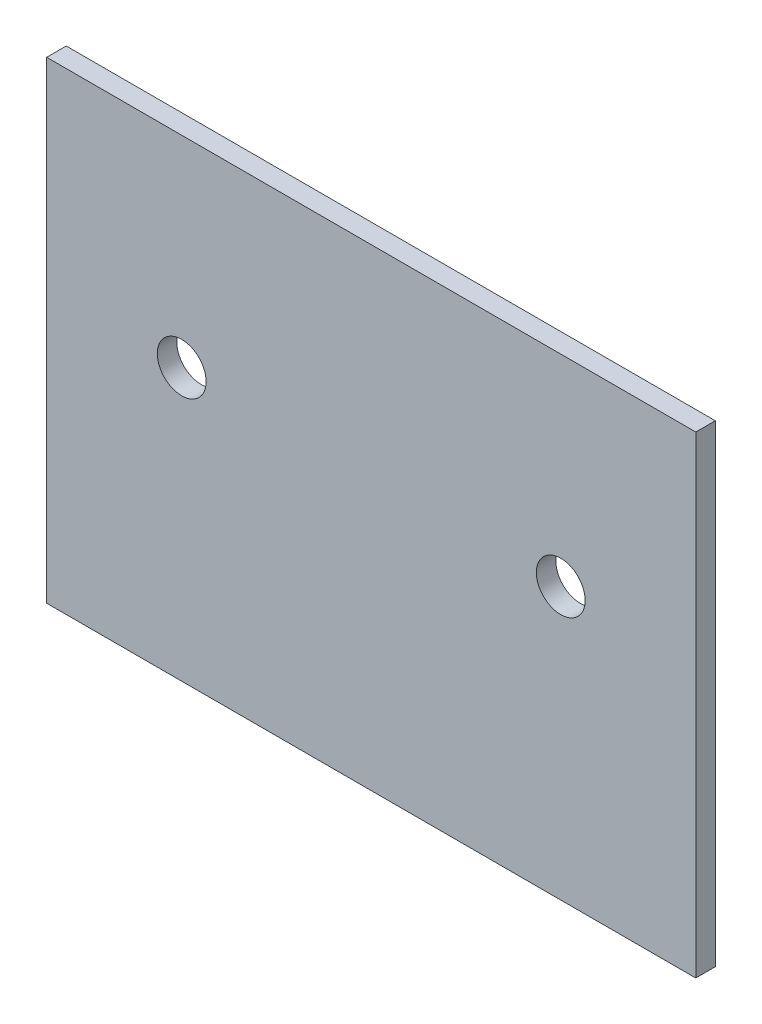
ISO-10303-21;
HEADER;
FILE_DESCRIPTION(('STEP AP214'),'2;1');
FILE_NAME('part.step','',(''),(''),'','','');
FILE_SCHEMA(('AUTOMOTIVE_DESIGN { 1 0 10303 214 1 1 1 1 }'));
ENDSEC;
DATA;
#1=APPLICATION_CONTEXT('core data for automotive mechanical design processes');
#2=APPLICATION_PROTOCOL_DEFINITION('international standard','automotive_design',2000,#1);
#3=PRODUCT_CONTEXT('',#1,'mechanical');
#4=PRODUCT('Part','Part','',(#3));
#5=PRODUCT_RELATED_PRODUCT_CATEGORY('part','',(#4));
#6=PRODUCT_DEFINITION_FORMATION('','',#4);
#7=PRODUCT_DEFINITION_CONTEXT('part definition',#1,'design');
#8=PRODUCT_DEFINITION('design','',#6,#7);
#9=PRODUCT_DEFINITION_SHAPE('','',#8);
#10=(LENGTH_UNIT() NAMED_UNIT(*) SI_UNIT(.MILLI.,.METRE.));
#11=(NAMED_UNIT(*) PLANE_ANGLE_UNIT() SI_UNIT($,.RADIAN.));
#12=(NAMED_UNIT(*) SI_UNIT($,.STERADIAN.) SOLID_ANGLE_UNIT());
#13=UNCERTAINTY_MEASURE_WITH_UNIT(LENGTH_MEASURE(1.E-05),#10,'distance_accuracy_value','');
#14=(GEOMETRIC_REPRESENTATION_CONTEXT(3) GLOBAL_UNCERTAINTY_ASSIGNED_CONTEXT((#13)) GLOBAL_UNIT_ASSIGNED_CONTEXT((#10,
#11,#12)) REPRESENTATION_CONTEXT('',''));
#15=CARTESIAN_POINT('',(0.,0.,0.));
#16=DIRECTION('',(0.,0.,1.));
#17=DIRECTION('',(1.,0.,0.));
#18=AXIS2_PLACEMENT_3D('',#15,#16,#17);
#19=CARTESIAN_POINT('',(16.61,12.1,1.));
#20=DIRECTION('',(-1.,0.,0.));
#21=DIRECTION('',(0.,-1.,0.));
#22=AXIS2_PLACEMENT_3D('',#19,#20,#21);
#23=PLANE('',#22);
#24=DIRECTION('',(0.,1.,0.));
#25=VECTOR('',#24,1.);
#26=CARTESIAN_POINT('',(16.61,12.1,0.));
#27=LINE('',#26,#25);
#28=CARTESIAN_POINT('',(16.61,-12.1,0.));
#29=VERTEX_POINT('',#28);
#30=CARTESIAN_POINT('',(16.61,12.1,0.));
#31=VERTEX_POINT('',#30);
#32=EDGE_CURVE('E95',#29,#31,#27,.T.);
#33=ORIENTED_EDGE('',*,*,#32,.T.);
#34=DIRECTION('',(0.,0.,-1.));
#35=VECTOR('',#34,1.);
#36=CARTESIAN_POINT('',(16.61,12.1,1.));
#37=LINE('',#36,#35);
#38=CARTESIAN_POINT('',(16.61,12.1,1.));
#39=VERTEX_POINT('',#38);
#40=EDGE_CURVE('E11',#39,#31,#37,.T.);
#41=ORIENTED_EDGE('',*,*,#40,.F.);
#42=DIRECTION('',(0.,1.,0.));
#43=VECTOR('',#42,1.);
#44=CARTESIAN_POINT('',(16.61,12.1,1.));
#45=LINE('',#44,#43);
#46=CARTESIAN_POINT('',(16.61,-12.1,1.));
#47=VERTEX_POINT('',#46);
#48=EDGE_CURVE('E83',#47,#39,#45,.T.);
#49=ORIENTED_EDGE('',*,*,#48,.F.);
#50=DIRECTION('',(0.,0.,-1.));
#51=VECTOR('',#50,1.);
#52=CARTESIAN_POINT('',(16.61,-12.1,1.));
#53=LINE('',#52,#51);
#54=EDGE_CURVE('E91',#47,#29,#53,.T.);
#55=ORIENTED_EDGE('',*,*,#54,.T.);
#56=EDGE_LOOP('',(#33,#41,#49,#55));
#57=FACE_BOUND('',#56,.T.);
#58=ADVANCED_FACE('F32',(#57),#23,.F.);
#59=CARTESIAN_POINT('',(-16.61,12.1,1.));
#60=DIRECTION('',(0.,-1.,0.));
#61=DIRECTION('',(0.,0.,-1.));
#62=AXIS2_PLACEMENT_3D('',#59,#60,#61);
#63=PLANE('',#62);
#64=DIRECTION('',(-1.,0.,0.));
#65=VECTOR('',#64,1.);
#66=CARTESIAN_POINT('',(-16.61,12.1,0.));
#67=LINE('',#66,#65);
#68=CARTESIAN_POINT('',(-16.61,12.1,0.));
#69=VERTEX_POINT('',#68);
#70=EDGE_CURVE('E87',#31,#69,#67,.T.);
#71=ORIENTED_EDGE('',*,*,#70,.T.);
#72=DIRECTION('',(0.,0.,-1.));
#73=VECTOR('',#72,1.);
#74=CARTESIAN_POINT('',(-16.61,12.1,1.));
#75=LINE('',#74,#73);
#76=CARTESIAN_POINT('',(-16.61,12.1,1.));
#77=VERTEX_POINT('',#76);
#78=EDGE_CURVE('E40',#77,#69,#75,.T.);
#79=ORIENTED_EDGE('',*,*,#78,.F.);
#80=DIRECTION('',(-1.,0.,0.));
#81=VECTOR('',#80,1.);
#82=CARTESIAN_POINT('',(-16.61,12.1,1.));
#83=LINE('',#82,#81);
#84=EDGE_CURVE('E78',#39,#77,#83,.T.);
#85=ORIENTED_EDGE('',*,*,#84,.F.);
#86=ORIENTED_EDGE('',*,*,#40,.T.);
#87=EDGE_LOOP('',(#71,#79,#85,#86));
#88=FACE_BOUND('',#87,.T.);
#89=ADVANCED_FACE('F86',(#88),#63,.F.);
#90=CARTESIAN_POINT('',(-16.61,12.1,1.));
#91=DIRECTION('',(1.,0.,0.));
#92=DIRECTION('',(0.,1.,0.));
#93=AXIS2_PLACEMENT_3D('',#90,#91,#92);
#94=PLANE('',#93);
#95=DIRECTION('',(0.,-1.,0.));
#96=VECTOR('',#95,1.);
#97=CARTESIAN_POINT('',(-16.61,12.1,0.));
#98=LINE('',#97,#96);
#99=CARTESIAN_POINT('',(-16.61,-12.1,0.));
#100=VERTEX_POINT('',#99);
#101=EDGE_CURVE('E65',#69,#100,#98,.T.);
#102=ORIENTED_EDGE('',*,*,#101,.T.);
#103=DIRECTION('',(0.,0.,-1.));
#104=VECTOR('',#103,1.);
#105=CARTESIAN_POINT('',(-16.61,-12.1,1.));
#106=LINE('',#105,#104);
#107=CARTESIAN_POINT('',(-16.61,-12.1,1.));
#108=VERTEX_POINT('',#107);
#109=EDGE_CURVE('E88',#108,#100,#106,.T.);
#110=ORIENTED_EDGE('',*,*,#109,.F.);
#111=DIRECTION('',(0.,-1.,0.));
#112=VECTOR('',#111,1.);
#113=CARTESIAN_POINT('',(-16.61,12.1,1.));
#114=LINE('',#113,#112);
#115=EDGE_CURVE('E81',#77,#108,#114,.T.);
#116=ORIENTED_EDGE('',*,*,#115,.F.);
#117=ORIENTED_EDGE('',*,*,#78,.T.);
#118=EDGE_LOOP('',(#102,#110,#116,#117));
#119=FACE_BOUND('',#118,.T.);
#120=ADVANCED_FACE('F89',(#119),#94,.F.);
#121=CARTESIAN_POINT('',(-16.61,-12.1,1.));
#122=DIRECTION('',(0.,1.,0.));
#123=DIRECTION('',(0.,0.,1.));
#124=AXIS2_PLACEMENT_3D('',#121,#122,#123);
#125=PLANE('',#124);
#126=DIRECTION('',(1.,0.,0.));
#127=VECTOR('',#126,1.);
#128=CARTESIAN_POINT('',(-16.61,-12.1,0.));
#129=LINE('',#128,#127);
#130=EDGE_CURVE('E71',#100,#29,#129,.T.);
#131=ORIENTED_EDGE('',*,*,#130,.T.);
#132=ORIENTED_EDGE('',*,*,#54,.F.);
#133=DIRECTION('',(1.,0.,0.));
#134=VECTOR('',#133,1.);
#135=CARTESIAN_POINT('',(-16.61,-12.1,1.));
#136=LINE('',#135,#134);
#137=EDGE_CURVE('E48',#108,#47,#136,.T.);
#138=ORIENTED_EDGE('',*,*,#137,.F.);
#139=ORIENTED_EDGE('',*,*,#109,.T.);
#140=EDGE_LOOP('',(#131,#132,#138,#139));
#141=FACE_BOUND('',#140,.T.);
#142=ADVANCED_FACE('F103',(#141),#125,.F.);
#143=CARTESIAN_POINT('',(0.,0.,1.));
#144=DIRECTION('',(0.,0.,1.));
#145=DIRECTION('',(1.,0.,0.));
#146=AXIS2_PLACEMENT_3D('',#143,#144,#145);
#147=PLANE('',#146);
#148=CARTESIAN_POINT('',(-9.7,1.8,1.));
#149=DIRECTION('',(0.,0.,1.));
#150=DIRECTION('',(1.,0.,0.));
#151=AXIS2_PLACEMENT_3D('',#148,#149,#150);
#152=CIRCLE('',#151,1.25);
#153=CARTESIAN_POINT('',(-8.45,1.8,1.));
#154=VERTEX_POINT('',#153);
#155=EDGE_CURVE('E115',#154,#154,#152,.T.);
#156=ORIENTED_EDGE('',*,*,#155,.F.);
#157=EDGE_LOOP('',(#156));
#158=FACE_BOUND('',#157,.T.);
#159=CARTESIAN_POINT('',(9.7,1.8,1.));
#160=DIRECTION('',(0.,0.,1.));
#161=DIRECTION('',(1.,0.,0.));
#162=AXIS2_PLACEMENT_3D('',#159,#160,#161);
#163=CIRCLE('',#162,1.25);
#164=CARTESIAN_POINT('',(10.95,1.8,1.));
#165=VERTEX_POINT('',#164);
#166=EDGE_CURVE('E109',#165,#165,#163,.T.);
#167=ORIENTED_EDGE('',*,*,#166,.F.);
#168=EDGE_LOOP('',(#167));
#169=FACE_BOUND('',#168,.T.);
#170=ORIENTED_EDGE('',*,*,#48,.T.);
#171=ORIENTED_EDGE('',*,*,#84,.T.);
#172=ORIENTED_EDGE('',*,*,#115,.T.);
#173=ORIENTED_EDGE('',*,*,#137,.T.);
#174=EDGE_LOOP('',(#170,#171,#172,#173));
#175=FACE_BOUND('',#174,.T.);
#176=ADVANCED_FACE('F79',(#158,#169,#175),#147,.T.);
#177=CARTESIAN_POINT('',(0.,0.,0.));
#178=DIRECTION('',(0.,0.,1.));
#179=DIRECTION('',(1.,0.,0.));
#180=AXIS2_PLACEMENT_3D('',#177,#178,#179);
#181=PLANE('',#180);
#182=CARTESIAN_POINT('',(-9.7,1.8,0.));
#183=DIRECTION('',(0.,0.,1.));
#184=DIRECTION('',(1.,0.,0.));
#185=AXIS2_PLACEMENT_3D('',#182,#183,#184);
#186=CIRCLE('',#185,1.25);
#187=CARTESIAN_POINT('',(-8.45,1.8,0.));
#188=VERTEX_POINT('',#187);
#189=EDGE_CURVE('E112',#188,#188,#186,.T.);
#190=ORIENTED_EDGE('',*,*,#189,.T.);
#191=EDGE_LOOP('',(#190));
#192=FACE_BOUND('',#191,.T.);
#193=CARTESIAN_POINT('',(9.7,1.8,0.));
#194=DIRECTION('',(0.,0.,1.));
#195=DIRECTION('',(1.,0.,0.));
#196=AXIS2_PLACEMENT_3D('',#193,#194,#195);
#197=CIRCLE('',#196,1.25);
#198=CARTESIAN_POINT('',(10.95,1.8,0.));
#199=VERTEX_POINT('',#198);
#200=EDGE_CURVE('E98',#199,#199,#197,.T.);
#201=ORIENTED_EDGE('',*,*,#200,.T.);
#202=EDGE_LOOP('',(#201));
#203=FACE_BOUND('',#202,.T.);
#204=ORIENTED_EDGE('',*,*,#32,.F.);
#205=ORIENTED_EDGE('',*,*,#130,.F.);
#206=ORIENTED_EDGE('',*,*,#101,.F.);
#207=ORIENTED_EDGE('',*,*,#70,.F.);
#208=EDGE_LOOP('',(#204,#205,#206,#207));
#209=FACE_BOUND('',#208,.T.);
#210=ADVANCED_FACE('F106',(#192,#203,#209),#181,.F.);
#211=CARTESIAN_POINT('',(9.7,1.8,0.));
#212=DIRECTION('',(0.,0.,1.));
#213=DIRECTION('',(1.,0.,0.));
#214=AXIS2_PLACEMENT_3D('',#211,#212,#213);
#215=CYLINDRICAL_SURFACE('',#214,1.25);
#216=ORIENTED_EDGE('',*,*,#200,.F.);
#217=EDGE_LOOP('',(#216));
#218=FACE_BOUND('',#217,.T.);
#219=ORIENTED_EDGE('',*,*,#166,.T.);
#220=EDGE_LOOP('',(#219));
#221=FACE_BOUND('',#220,.T.);
#222=ADVANCED_FACE('F126',(#218,#221),#215,.F.);
#223=CARTESIAN_POINT('',(-9.7,1.8,0.));
#224=DIRECTION('',(0.,0.,1.));
#225=DIRECTION('',(1.,0.,0.));
#226=AXIS2_PLACEMENT_3D('',#223,#224,#225);
#227=CYLINDRICAL_SURFACE('',#226,1.25);
#228=ORIENTED_EDGE('',*,*,#189,.F.);
#229=EDGE_LOOP('',(#228));
#230=FACE_BOUND('',#229,.T.);
#231=ORIENTED_EDGE('',*,*,#155,.T.);
#232=EDGE_LOOP('',(#231));
#233=FACE_BOUND('',#232,.T.);
#234=ADVANCED_FACE('F123',(#230,#233),#227,.F.);
#235=CLOSED_SHELL('',(#58,#89,#120,#142,#176,#210,#222,#234));
#236=MANIFOLD_SOLID_BREP('B2',#235);
#237=ADVANCED_BREP_SHAPE_REPRESENTATION('',(#18,#236),#14);
#238=SHAPE_DEFINITION_REPRESENTATION(#9,#237);
ENDSEC;
END-ISO-10303-21;
